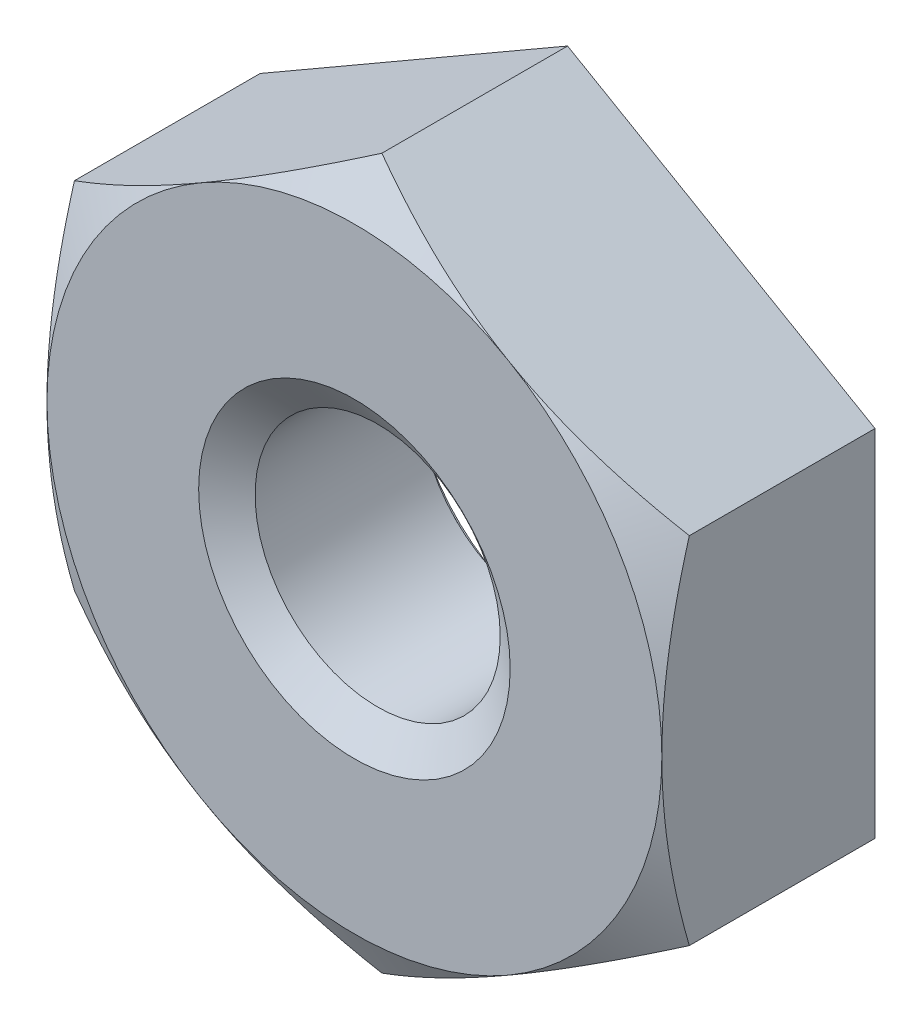
ISO-10303-21;
HEADER;
FILE_DESCRIPTION(('STEP AP214'),'2;1');
FILE_NAME('part.step','',(''),(''),'','','');
FILE_SCHEMA(('AUTOMOTIVE_DESIGN { 1 0 10303 214 1 1 1 1 }'));
ENDSEC;
DATA;
#1=APPLICATION_CONTEXT('core data for automotive mechanical design processes');
#2=APPLICATION_PROTOCOL_DEFINITION('international standard','automotive_design',2000,#1);
#3=PRODUCT_CONTEXT('',#1,'mechanical');
#4=PRODUCT('Part','Part','',(#3));
#5=PRODUCT_RELATED_PRODUCT_CATEGORY('part','',(#4));
#6=PRODUCT_DEFINITION_FORMATION('','',#4);
#7=PRODUCT_DEFINITION_CONTEXT('part definition',#1,'design');
#8=PRODUCT_DEFINITION('design','',#6,#7);
#9=PRODUCT_DEFINITION_SHAPE('','',#8);
#10=(LENGTH_UNIT() NAMED_UNIT(*) SI_UNIT(.MILLI.,.METRE.));
#11=(NAMED_UNIT(*) PLANE_ANGLE_UNIT() SI_UNIT($,.RADIAN.));
#12=(NAMED_UNIT(*) SI_UNIT($,.STERADIAN.) SOLID_ANGLE_UNIT());
#13=UNCERTAINTY_MEASURE_WITH_UNIT(LENGTH_MEASURE(1.E-05),#10,'distance_accuracy_value','');
#14=(GEOMETRIC_REPRESENTATION_CONTEXT(3) GLOBAL_UNCERTAINTY_ASSIGNED_CONTEXT((#13)) GLOBAL_UNIT_ASSIGNED_CONTEXT((#10,
#11,#12)) REPRESENTATION_CONTEXT('',''));
#15=CARTESIAN_POINT('',(0.,0.,0.));
#16=DIRECTION('',(0.,0.,1.));
#17=DIRECTION('',(1.,0.,0.));
#18=AXIS2_PLACEMENT_3D('',#15,#16,#17);
#19=CARTESIAN_POINT('',(0.,0.,-3.302));
#20=DIRECTION('',(0.,0.,1.));
#21=DIRECTION('',(1.,0.,0.));
#22=AXIS2_PLACEMENT_3D('',#19,#20,#21);
#23=CYLINDRICAL_SURFACE('',#22,1.89865);
#24=CARTESIAN_POINT('',(0.,0.,-0.360151747278165));
#25=DIRECTION('',(0.,0.,1.));
#26=DIRECTION('',(1.,0.,0.));
#27=AXIS2_PLACEMENT_3D('',#24,#25,#26);
#28=CIRCLE('',#27,1.89865);
#29=CARTESIAN_POINT('',(1.89865,0.,-0.360151747278165));
#30=VERTEX_POINT('',#29);
#31=EDGE_CURVE('E132',#30,#30,#28,.F.);
#32=ORIENTED_EDGE('',*,*,#31,.F.);
#33=EDGE_LOOP('',(#32));
#34=FACE_BOUND('',#33,.T.);
#35=CARTESIAN_POINT('',(0.,0.,-2.91644825272183));
#36=DIRECTION('',(0.,0.,-1.));
#37=DIRECTION('',(-1.,0.,0.));
#38=AXIS2_PLACEMENT_3D('',#35,#36,#37);
#39=CIRCLE('',#38,1.89865);
#40=CARTESIAN_POINT('',(-1.89865,0.,-2.91644825272183));
#41=VERTEX_POINT('',#40);
#42=EDGE_CURVE('E38',#41,#41,#39,.F.);
#43=ORIENTED_EDGE('',*,*,#42,.F.);
#44=EDGE_LOOP('',(#43));
#45=FACE_BOUND('',#44,.T.);
#46=ADVANCED_FACE('F33',(#34,#45),#23,.F.);
#47=CARTESIAN_POINT('',(0.,5.49926131403119,-3.302));
#48=DIRECTION('',(-0.5,0.866025403784438,0.));
#49=DIRECTION('',(-0.866025403784438,-0.5,0.));
#50=AXIS2_PLACEMENT_3D('',#47,#48,#49);
#51=PLANE('',#50);
#52=DIRECTION('',(0.,0.,1.));
#53=VECTOR('',#52,1.);
#54=CARTESIAN_POINT('',(-4.7625,2.74963065701559,-3.302));
#55=LINE('',#54,#53);
#56=CARTESIAN_POINT('',(-4.7625,2.74963065701559,-3.302));
#57=VERTEX_POINT('',#56);
#58=CARTESIAN_POINT('',(-4.7625,2.74963065701559,-0.42536934298441));
#59=VERTEX_POINT('',#58);
#60=EDGE_CURVE('E229',#57,#59,#55,.T.);
#61=ORIENTED_EDGE('',*,*,#60,.T.);
#62=CARTESIAN_POINT('',(-4.7627,2.74951518696175,-0.425436011750768));
#63=CARTESIAN_POINT('',(-4.55340263838612,2.8703530750302,-0.355653612413946));
#64=CARTESIAN_POINT('',(-4.34231515161877,2.9922244923379,-0.292183264615225));
#65=CARTESIAN_POINT('',(-3.91648500907588,3.23807763976409,-0.181395196068724));
#66=CARTESIAN_POINT('',(-3.701734787416,3.36206373804796,-0.134116665429797));
#67=CARTESIAN_POINT('',(-3.27486304406647,3.60851825398025,-0.0605335253687856));
#68=CARTESIAN_POINT('',(-3.06280800150458,3.73094828988637,-0.0337387922017277));
#69=CARTESIAN_POINT('',(-2.7439794939507,3.91502401454793,-0.0097111221808775));
#70=CARTESIAN_POINT('',(-2.63763059112772,3.97642458222081,-0.00439464100931432));
#71=CARTESIAN_POINT('',(-2.42483449751002,4.09928246415348,0.000759836568293832));
#72=CARTESIAN_POINT('',(-2.31838730985274,4.1607397766019,0.000598002190792683));
#73=CARTESIAN_POINT('',(-2.02675051194544,4.32911636037927,-0.00738494982191049));
#74=CARTESIAN_POINT('',(-1.84165753319303,4.43597984148709,-0.0207924204878942));
#75=CARTESIAN_POINT('',(-1.47270002105863,4.64899756043742,-0.0633078628436923));
#76=CARTESIAN_POINT('',(-1.28883678458933,4.75515104950704,-0.0924303682801016));
#77=CARTESIAN_POINT('',(-0.919135889202233,4.96859796097843,-0.165229253586901));
#78=CARTESIAN_POINT('',(-0.733344890273213,5.07586444422311,-0.209214113046655));
#79=CARTESIAN_POINT('',(-0.364533730991679,5.28879766631444,-0.309042279938828));
#80=CARTESIAN_POINT('',(-0.181508846544092,5.39446713261866,-0.364862134678058));
#81=CARTESIAN_POINT('',(0.000199999999998903,5.49937678408502,-0.425436011750769));
#82=B_SPLINE_CURVE_WITH_KNOTS('',3,(#62,#63,#64,#65,#66,#67,#68,#69,#70,#71,#72,#73,#74,#75,#76,
#77,#78,#79,#80,#81),.UNSPECIFIED.,.F.,.F.,(4,2,2,2,2,2,2,2,2,4),(0.,0.754910190012919,
1.51163483480638,2.24963134670895,2.61827336240839,2.9869039913527,3.6286742319225,
4.27103902109237,4.92765153591996,5.58297484368455),.UNSPECIFIED.);
#83=CARTESIAN_POINT('',(-2.38125,4.12444598552339,0.));
#84=VERTEX_POINT('',#83);
#85=EDGE_CURVE('E118',#59,#84,#82,.T.);
#86=ORIENTED_EDGE('',*,*,#85,.T.);
#87=CARTESIAN_POINT('',(0.,5.49926131403119,-0.425369342984409));
#88=VERTEX_POINT('',#87);
#89=EDGE_CURVE('E144',#84,#88,#82,.T.);
#90=ORIENTED_EDGE('',*,*,#89,.T.);
#91=DIRECTION('',(0.,0.,1.));
#92=VECTOR('',#91,1.);
#93=CARTESIAN_POINT('',(0.,5.49926131403119,-3.302));
#94=LINE('',#93,#92);
#95=CARTESIAN_POINT('',(0.,5.49926131403119,-3.302));
#96=VERTEX_POINT('',#95);
#97=EDGE_CURVE('E241',#96,#88,#94,.T.);
#98=ORIENTED_EDGE('',*,*,#97,.F.);
#99=DIRECTION('',(-0.866025403784438,-0.5,0.));
#100=VECTOR('',#99,1.);
#101=CARTESIAN_POINT('',(0.,5.49926131403119,-3.302));
#102=LINE('',#101,#100);
#103=EDGE_CURVE('E257',#96,#57,#102,.T.);
#104=ORIENTED_EDGE('',*,*,#103,.T.);
#105=EDGE_LOOP('',(#61,#86,#90,#98,#104));
#106=FACE_BOUND('',#105,.T.);
#107=ADVANCED_FACE('F35',(#106),#51,.T.);
#108=CARTESIAN_POINT('',(4.7625,2.74963065701559,-3.302));
#109=DIRECTION('',(0.5,0.866025403784438,0.));
#110=DIRECTION('',(-0.866025403784439,0.5,0.));
#111=AXIS2_PLACEMENT_3D('',#108,#109,#110);
#112=PLANE('',#111);
#113=ORIENTED_EDGE('',*,*,#97,.T.);
#114=CARTESIAN_POINT('',(-0.00020000000000067,5.49937678408502,-0.425436011750769));
#115=CARTESIAN_POINT('',(0.209097361613878,5.37853889601657,-0.355653612413947));
#116=CARTESIAN_POINT('',(0.420184848381228,5.25666747870888,-0.292183264615226));
#117=CARTESIAN_POINT('',(0.846014990924115,5.01081433128269,-0.181395196068725));
#118=CARTESIAN_POINT('',(1.060765212584,4.88682823299882,-0.134116665429797));
#119=CARTESIAN_POINT('',(1.48763695593353,4.64037371706653,-0.0605335253687858));
#120=CARTESIAN_POINT('',(1.69969199849542,4.51794368116041,-0.0337387922017279));
#121=CARTESIAN_POINT('',(2.0185205060493,4.33386795649884,-0.0097111221808778));
#122=CARTESIAN_POINT('',(2.12486940887228,4.27246738882597,-0.00439464100931466));
#123=CARTESIAN_POINT('',(2.33766550248998,4.14960950689329,0.000759836568293665));
#124=CARTESIAN_POINT('',(2.44411269014726,4.08815219444488,0.000598002190792721));
#125=CARTESIAN_POINT('',(2.73574948805456,3.9197756106675,-0.00738494982191021));
#126=CARTESIAN_POINT('',(2.92084246680697,3.81291212955969,-0.0207924204878941));
#127=CARTESIAN_POINT('',(3.28979997894137,3.59989441060936,-0.063307862843692));
#128=CARTESIAN_POINT('',(3.47366321541067,3.49374092153974,-0.0924303682801009));
#129=CARTESIAN_POINT('',(3.84336411079777,3.28029401006835,-0.1652292535869));
#130=CARTESIAN_POINT('',(4.02915510972679,3.17302752682367,-0.209214113046654));
#131=CARTESIAN_POINT('',(4.39796626900832,2.96009430473234,-0.309042279938827));
#132=CARTESIAN_POINT('',(4.58099115345591,2.85442483842812,-0.364862134678057));
#133=CARTESIAN_POINT('',(4.7627,2.74951518696176,-0.425436011750768));
#134=B_SPLINE_CURVE_WITH_KNOTS('',3,(#114,#115,#116,#117,#118,#119,#120,#121,#122,#123,#124,
#125,#126,#127,#128,#129,#130,#131,#132,#133),.UNSPECIFIED.,.F.,.F.,(4,2,2,2,2,2,2,2,2,4),(0.,
0.754910190012918,1.51163483480638,2.24963134670895,2.61827336240839,2.9869039913527,
3.6286742319225,4.27103902109236,4.92765153591996,5.58297484368455),.UNSPECIFIED.);
#135=CARTESIAN_POINT('',(2.38125,4.12444598552339,0.));
#136=VERTEX_POINT('',#135);
#137=EDGE_CURVE('E140',#88,#136,#134,.T.);
#138=ORIENTED_EDGE('',*,*,#137,.T.);
#139=CARTESIAN_POINT('',(4.7625,2.74963065701559,-0.425369342984409));
#140=VERTEX_POINT('',#139);
#141=EDGE_CURVE('E127',#136,#140,#134,.T.);
#142=ORIENTED_EDGE('',*,*,#141,.T.);
#143=DIRECTION('',(0.,0.,1.));
#144=VECTOR('',#143,1.);
#145=CARTESIAN_POINT('',(4.7625,2.74963065701559,-3.302));
#146=LINE('',#145,#144);
#147=CARTESIAN_POINT('',(4.7625,2.74963065701559,-3.302));
#148=VERTEX_POINT('',#147);
#149=EDGE_CURVE('E139',#148,#140,#146,.T.);
#150=ORIENTED_EDGE('',*,*,#149,.F.);
#151=DIRECTION('',(-0.866025403784439,0.5,0.));
#152=VECTOR('',#151,1.);
#153=CARTESIAN_POINT('',(4.7625,2.74963065701559,-3.302));
#154=LINE('',#153,#152);
#155=EDGE_CURVE('E233',#148,#96,#154,.T.);
#156=ORIENTED_EDGE('',*,*,#155,.T.);
#157=EDGE_LOOP('',(#113,#138,#142,#150,#156));
#158=FACE_BOUND('',#157,.T.);
#159=ADVANCED_FACE('F209',(#158),#112,.T.);
#160=CARTESIAN_POINT('',(4.7625,2.74963065701559,-3.302));
#161=DIRECTION('',(-1.,0.,0.));
#162=DIRECTION('',(0.,0.,1.));
#163=AXIS2_PLACEMENT_3D('',#160,#161,#162);
#164=PLANE('',#163);
#165=CARTESIAN_POINT('',(4.7625,-7.29242571304484,-2.27898343403964));
#166=CARTESIAN_POINT('',(4.7625,-7.08332503258644,-2.17793443460892));
#167=CARTESIAN_POINT('',(4.7625,-6.87372996761939,-2.07788994627171));
#168=CARTESIAN_POINT('',(4.7625,-6.45328375890254,-1.88038400304187));
#169=CARTESIAN_POINT('',(4.7625,-6.24243240531597,-1.78292299537275));
#170=CARTESIAN_POINT('',(4.7625,-5.81806730761599,-1.59064459480452));
#171=CARTESIAN_POINT('',(4.7625,-5.60454523269943,-1.49584552190854));
#172=CARTESIAN_POINT('',(4.7625,-5.17574610716181,-1.31031922922938));
#173=CARTESIAN_POINT('',(4.7625,-4.96046914871243,-1.21959179719919));
#174=CARTESIAN_POINT('',(4.7625,-4.5251454275538,-1.04221436450315));
#175=CARTESIAN_POINT('',(4.7625,-4.30507255346546,-0.955628096677138));
#176=CARTESIAN_POINT('',(4.7625,-3.86233085885286,-0.789237026079922));
#177=CARTESIAN_POINT('',(4.7625,-3.6396617526365,-0.709432977795152));
#178=CARTESIAN_POINT('',(4.7625,-3.19183146915336,-0.558750437330524));
#179=CARTESIAN_POINT('',(4.7625,-2.96667674136296,-0.487852969464109));
#180=CARTESIAN_POINT('',(4.7625,-2.51316408606383,-0.357286935151366));
#181=CARTESIAN_POINT('',(4.7625,-2.28480719615869,-0.297614817726105));
#182=CARTESIAN_POINT('',(4.7625,-1.82474524250015,-0.192393335725107));
#183=CARTESIAN_POINT('',(4.7625,-1.59303930440612,-0.146847731515044));
#184=CARTESIAN_POINT('',(4.7625,-1.12680140245445,-0.0729572667243255));
#185=CARTESIAN_POINT('',(4.7625,-0.892269436098448,-0.044612421351302));
#186=CARTESIAN_POINT('',(4.7625,-0.54009824342306,-0.0168127698224292));
#187=CARTESIAN_POINT('',(4.7625,-0.423010288487476,-0.00999774479560567));
#188=CARTESIAN_POINT('',(4.7625,-0.188645495023605,-0.00132916739532984));
#189=CARTESIAN_POINT('',(4.7625,-0.0713686589679975,0.000524449409052411));
#190=CARTESIAN_POINT('',(4.7625,0.163123105354889,-0.000779595326750137));
#191=CARTESIAN_POINT('',(4.7625,0.280338041752277,-0.00393584200216364));
#192=CARTESIAN_POINT('',(4.7625,0.514533140154534,-0.0151795737408435));
#193=CARTESIAN_POINT('',(4.7625,0.631513289308025,-0.0232673217280265));
#194=CARTESIAN_POINT('',(4.7625,0.915050030184752,-0.0486788919016494));
#195=CARTESIAN_POINT('',(4.7625,1.08138937418057,-0.0684745311551047));
#196=CARTESIAN_POINT('',(4.7625,1.41276151801412,-0.116933997609662));
#197=CARTESIAN_POINT('',(4.7625,1.57779414061617,-0.145599007360524));
#198=CARTESIAN_POINT('',(4.7625,2.07083902042289,-0.243383100627567));
#199=CARTESIAN_POINT('',(4.7625,2.39654516294855,-0.324265654459847));
#200=CARTESIAN_POINT('',(4.7625,2.88391142522151,-0.463767781303893));
#201=CARTESIAN_POINT('',(4.7625,3.04811363656015,-0.514009375908409));
#202=CARTESIAN_POINT('',(4.7625,3.37480455011008,-0.619463864370054));
#203=CARTESIAN_POINT('',(4.7625,3.53729434901436,-0.674673329356533));
#204=CARTESIAN_POINT('',(4.7625,3.85988055284394,-0.788914900372858));
#205=CARTESIAN_POINT('',(4.7625,4.01998528140539,-0.847923740867389));
#206=CARTESIAN_POINT('',(4.7625,4.33895253974561,-0.969404920092013));
#207=CARTESIAN_POINT('',(4.7625,4.49781453744471,-1.03187865865025));
#208=CARTESIAN_POINT('',(4.7625,4.65610216606021,-1.09574291091383));
#209=B_SPLINE_CURVE_WITH_KNOTS('',3,(#165,#166,#167,#168,#169,#170,#171,#172,#173,#174,#175,
#176,#177,#178,#179,#180,#181,#182,#183,#184,#185,#186,#187,#188,#189,#190,#191,#192,#193,#194,
#195,#196,#197,#198,#199,#200,#201,#202,#203,#204,#205,#206,#207,#208),.UNSPECIFIED.,.F.,.F.,(4,
2,2,2,2,2,2,2,2,2,2,2,2,2,2,2,2,2,2,2,2,4),(0.,0.696720165483734,1.39356016205725,
2.09438789250381,2.79517904757872,3.50457374312629,4.21404725210226,4.9219826078058,
5.6296936403172,6.33759289852653,7.04549278260686,7.39726182154395,7.74902629223847,
8.10069143675107,8.45237533199633,8.95462912158064,9.45694990534677,10.4623513294482,
10.9774608355396,11.4922174961111,12.0040767603637,12.5161443452105),.UNSPECIFIED.);
#210=CARTESIAN_POINT('',(4.7625,-2.74963065701559,-0.425369342984409));
#211=VERTEX_POINT('',#210);
#212=CARTESIAN_POINT('',(4.7625,0.,0.));
#213=VERTEX_POINT('',#212);
#214=EDGE_CURVE('E107',#211,#213,#209,.T.);
#215=ORIENTED_EDGE('',*,*,#214,.F.);
#216=DIRECTION('',(0.,0.,1.));
#217=VECTOR('',#216,1.);
#218=CARTESIAN_POINT('',(4.7625,-2.74963065701559,-3.302));
#219=LINE('',#218,#217);
#220=CARTESIAN_POINT('',(4.7625,-2.74963065701559,-3.302));
#221=VERTEX_POINT('',#220);
#222=EDGE_CURVE('E238',#221,#211,#219,.T.);
#223=ORIENTED_EDGE('',*,*,#222,.F.);
#224=DIRECTION('',(0.,-1.,0.));
#225=VECTOR('',#224,1.);
#226=CARTESIAN_POINT('',(4.7625,2.74963065701559,-3.302));
#227=LINE('',#226,#225);
#228=EDGE_CURVE('E246',#148,#221,#227,.T.);
#229=ORIENTED_EDGE('',*,*,#228,.F.);
#230=ORIENTED_EDGE('',*,*,#149,.T.);
#231=EDGE_CURVE('E120',#213,#140,#209,.T.);
#232=ORIENTED_EDGE('',*,*,#231,.F.);
#233=EDGE_LOOP('',(#215,#223,#229,#230,#232));
#234=FACE_BOUND('',#233,.T.);
#235=ADVANCED_FACE('F137',(#234),#164,.F.);
#236=CARTESIAN_POINT('',(0.,-5.49926131403119,-3.302));
#237=DIRECTION('',(0.5,-0.866025403784438,0.));
#238=DIRECTION('',(0.866025403784438,0.5,0.));
#239=AXIS2_PLACEMENT_3D('',#236,#237,#238);
#240=PLANE('',#239);
#241=ORIENTED_EDGE('',*,*,#222,.T.);
#242=CARTESIAN_POINT('',(4.7627,-2.74951518696176,-0.425436011750769));
#243=CARTESIAN_POINT('',(4.55340263838612,-2.87035307503021,-0.355653612413947));
#244=CARTESIAN_POINT('',(4.34231515161877,-2.9922244923379,-0.292183264615226));
#245=CARTESIAN_POINT('',(3.91648500907589,-3.23807763976409,-0.181395196068725));
#246=CARTESIAN_POINT('',(3.701734787416,-3.36206373804796,-0.134116665429798));
#247=CARTESIAN_POINT('',(3.27486304406647,-3.60851825398025,-0.0605335253687867));
#248=CARTESIAN_POINT('',(3.06280800150458,-3.73094828988638,-0.0337387922017292));
#249=CARTESIAN_POINT('',(2.7439794939507,-3.91502401454794,-0.00971112218087938));
#250=CARTESIAN_POINT('',(2.63763059112771,-3.97642458222081,-0.00439464100931626));
#251=CARTESIAN_POINT('',(2.42483449751002,-4.09928246415349,0.000759836568292012));
#252=CARTESIAN_POINT('',(2.31838730985274,-4.1607397766019,0.000598002190791066));
#253=CARTESIAN_POINT('',(2.02675051194544,-4.32911636037928,-0.00738494982191179));
#254=CARTESIAN_POINT('',(1.84165753319303,-4.43597984148709,-0.0207924204878956));
#255=CARTESIAN_POINT('',(1.47270002105863,-4.64899756043742,-0.063307862843694));
#256=CARTESIAN_POINT('',(1.28883678458933,-4.75515104950705,-0.0924303682801035));
#257=CARTESIAN_POINT('',(0.919135889202232,-4.96859796097843,-0.165229253586903));
#258=CARTESIAN_POINT('',(0.733344890273212,-5.07586444422311,-0.209214113046657));
#259=CARTESIAN_POINT('',(0.364533730991679,-5.28879766631445,-0.30904227993883));
#260=CARTESIAN_POINT('',(0.181508846544092,-5.39446713261866,-0.36486213467806));
#261=CARTESIAN_POINT('',(-0.00019999999999926,-5.49937678408503,-0.425436011750771));
#262=B_SPLINE_CURVE_WITH_KNOTS('',3,(#242,#243,#244,#245,#246,#247,#248,#249,#250,#251,#252,
#253,#254,#255,#256,#257,#258,#259,#260,#261),.UNSPECIFIED.,.F.,.F.,(4,2,2,2,2,2,2,2,2,4),(0.,
0.754910190012918,1.51163483480638,2.24963134670895,2.61827336240839,2.9869039913527,
3.6286742319225,4.27103902109237,4.92765153591996,5.58297484368455),.UNSPECIFIED.);
#263=CARTESIAN_POINT('',(2.38125,-4.12444598552339,0.));
#264=VERTEX_POINT('',#263);
#265=EDGE_CURVE('E113',#211,#264,#262,.T.);
#266=ORIENTED_EDGE('',*,*,#265,.T.);
#267=CARTESIAN_POINT('',(0.,-5.49926131403119,-0.425369342984409));
#268=VERTEX_POINT('',#267);
#269=EDGE_CURVE('E52',#264,#268,#262,.T.);
#270=ORIENTED_EDGE('',*,*,#269,.T.);
#271=DIRECTION('',(0.,0.,1.));
#272=VECTOR('',#271,1.);
#273=CARTESIAN_POINT('',(0.,-5.49926131403119,-3.302));
#274=LINE('',#273,#272);
#275=CARTESIAN_POINT('',(0.,-5.49926131403119,-3.302));
#276=VERTEX_POINT('',#275);
#277=EDGE_CURVE('E235',#276,#268,#274,.T.);
#278=ORIENTED_EDGE('',*,*,#277,.F.);
#279=DIRECTION('',(0.866025403784438,0.5,0.));
#280=VECTOR('',#279,1.);
#281=CARTESIAN_POINT('',(0.,-5.49926131403119,-3.302));
#282=LINE('',#281,#280);
#283=EDGE_CURVE('E248',#276,#221,#282,.T.);
#284=ORIENTED_EDGE('',*,*,#283,.T.);
#285=EDGE_LOOP('',(#241,#266,#270,#278,#284));
#286=FACE_BOUND('',#285,.T.);
#287=ADVANCED_FACE('F191',(#286),#240,.T.);
#288=CARTESIAN_POINT('',(-4.7625,-2.7496306570156,-3.302));
#289=DIRECTION('',(-0.5,-0.866025403784438,0.));
#290=DIRECTION('',(0.866025403784438,-0.5,0.));
#291=AXIS2_PLACEMENT_3D('',#288,#289,#290);
#292=PLANE('',#291);
#293=ORIENTED_EDGE('',*,*,#277,.T.);
#294=CARTESIAN_POINT('',(0.000200000000000027,-5.49937678408503,-0.425436011750772));
#295=CARTESIAN_POINT('',(-0.209097361613879,-5.37853889601658,-0.355653612413949));
#296=CARTESIAN_POINT('',(-0.420184848381229,-5.25666747870889,-0.292183264615228));
#297=CARTESIAN_POINT('',(-0.846014990924115,-5.01081433128269,-0.181395196068727));
#298=CARTESIAN_POINT('',(-1.060765212584,-4.88682823299882,-0.134116665429799));
#299=CARTESIAN_POINT('',(-1.48763695593353,-4.64037371706653,-0.0605335253687883));
#300=CARTESIAN_POINT('',(-1.69969199849542,-4.51794368116041,-0.0337387922017306));
#301=CARTESIAN_POINT('',(-2.0185205060493,-4.33386795649885,-0.0097111221808798));
#302=CARTESIAN_POINT('',(-2.12486940887229,-4.27246738882597,-0.00439464100931622));
#303=CARTESIAN_POINT('',(-2.33766550248998,-4.1496095068933,0.000759836568292223));
#304=CARTESIAN_POINT('',(-2.44411269014726,-4.08815219444489,0.000598002190790979));
#305=CARTESIAN_POINT('',(-2.73574948805456,-3.91977561066751,-0.00738494982191232));
#306=CARTESIAN_POINT('',(-2.92084246680697,-3.81291212955969,-0.020792420487896));
#307=CARTESIAN_POINT('',(-3.28979997894137,-3.59989441060936,-0.0633078628436935));
#308=CARTESIAN_POINT('',(-3.47366321541067,-3.49374092153974,-0.0924303682801024));
#309=CARTESIAN_POINT('',(-3.84336411079777,-3.28029401006835,-0.165229253586902));
#310=CARTESIAN_POINT('',(-4.02915510972679,-3.17302752682367,-0.209214113046655));
#311=CARTESIAN_POINT('',(-4.39796626900832,-2.96009430473234,-0.309042279938828));
#312=CARTESIAN_POINT('',(-4.58099115345591,-2.85442483842812,-0.364862134678059));
#313=CARTESIAN_POINT('',(-4.7627,-2.74951518696176,-0.425436011750769));
#314=B_SPLINE_CURVE_WITH_KNOTS('',3,(#294,#295,#296,#297,#298,#299,#300,#301,#302,#303,#304,
#305,#306,#307,#308,#309,#310,#311,#312,#313),.UNSPECIFIED.,.F.,.F.,(4,2,2,2,2,2,2,2,2,4),(0.,
0.754910190012918,1.51163483480638,2.24963134670895,2.6182733624084,2.9869039913527,
3.6286742319225,4.27103902109237,4.92765153591996,5.58297484368455),.UNSPECIFIED.);
#315=CARTESIAN_POINT('',(-2.38125,-4.12444598552339,0.));
#316=VERTEX_POINT('',#315);
#317=EDGE_CURVE('E185',#268,#316,#314,.T.);
#318=ORIENTED_EDGE('',*,*,#317,.T.);
#319=CARTESIAN_POINT('',(-4.7625,-2.74963065701559,-0.425369342984409));
#320=VERTEX_POINT('',#319);
#321=EDGE_CURVE('E59',#316,#320,#314,.T.);
#322=ORIENTED_EDGE('',*,*,#321,.T.);
#323=DIRECTION('',(0.,0.,1.));
#324=VECTOR('',#323,1.);
#325=CARTESIAN_POINT('',(-4.7625,-2.7496306570156,-3.302));
#326=LINE('',#325,#324);
#327=CARTESIAN_POINT('',(-4.7625,-2.7496306570156,-3.302));
#328=VERTEX_POINT('',#327);
#329=EDGE_CURVE('E232',#328,#320,#326,.T.);
#330=ORIENTED_EDGE('',*,*,#329,.F.);
#331=DIRECTION('',(0.866025403784438,-0.5,0.));
#332=VECTOR('',#331,1.);
#333=CARTESIAN_POINT('',(-4.7625,-2.7496306570156,-3.302));
#334=LINE('',#333,#332);
#335=EDGE_CURVE('E251',#328,#276,#334,.T.);
#336=ORIENTED_EDGE('',*,*,#335,.T.);
#337=EDGE_LOOP('',(#293,#318,#322,#330,#336));
#338=FACE_BOUND('',#337,.T.);
#339=ADVANCED_FACE('F187',(#338),#292,.T.);
#340=CARTESIAN_POINT('',(-4.7625,2.74963065701559,-3.302));
#341=DIRECTION('',(-1.,0.,0.));
#342=DIRECTION('',(0.,0.,1.));
#343=AXIS2_PLACEMENT_3D('',#340,#341,#342);
#344=PLANE('',#343);
#345=ORIENTED_EDGE('',*,*,#329,.T.);
#346=CARTESIAN_POINT('',(-4.7625,-7.29242571304484,-2.27898343403964));
#347=CARTESIAN_POINT('',(-4.7625,-7.08332503258644,-2.17793443460892));
#348=CARTESIAN_POINT('',(-4.7625,-6.87372996761939,-2.07788994627171));
#349=CARTESIAN_POINT('',(-4.7625,-6.45328375890254,-1.88038400304187));
#350=CARTESIAN_POINT('',(-4.7625,-6.24243240531597,-1.78292299537275));
#351=CARTESIAN_POINT('',(-4.7625,-5.81806730761599,-1.59064459480452));
#352=CARTESIAN_POINT('',(-4.7625,-5.60454523269943,-1.49584552190854));
#353=CARTESIAN_POINT('',(-4.7625,-5.17574610716181,-1.31031922922938));
#354=CARTESIAN_POINT('',(-4.7625,-4.96046914871242,-1.21959179719919));
#355=CARTESIAN_POINT('',(-4.7625,-4.5251454275538,-1.04221436450315));
#356=CARTESIAN_POINT('',(-4.7625,-4.30507255346546,-0.955628096677138));
#357=CARTESIAN_POINT('',(-4.7625,-3.86233085885286,-0.789237026079922));
#358=CARTESIAN_POINT('',(-4.7625,-3.6396617526365,-0.709432977795151));
#359=CARTESIAN_POINT('',(-4.7625,-3.19183146915336,-0.558750437330523));
#360=CARTESIAN_POINT('',(-4.7625,-2.96667674136296,-0.487852969464109));
#361=CARTESIAN_POINT('',(-4.7625,-2.51316408606383,-0.357286935151366));
#362=CARTESIAN_POINT('',(-4.7625,-2.28480719615869,-0.297614817726105));
#363=CARTESIAN_POINT('',(-4.7625,-1.82474524250015,-0.192393335725107));
#364=CARTESIAN_POINT('',(-4.7625,-1.59303930440612,-0.146847731515045));
#365=CARTESIAN_POINT('',(-4.7625,-1.12680140245445,-0.0729572667243259));
#366=CARTESIAN_POINT('',(-4.7625,-0.892269436098449,-0.0446124213513021));
#367=CARTESIAN_POINT('',(-4.7625,-0.540098243423061,-0.0168127698224291));
#368=CARTESIAN_POINT('',(-4.7625,-0.423010288487477,-0.00999774479560566));
#369=CARTESIAN_POINT('',(-4.7625,-0.188645495023606,-0.00132916739532985));
#370=CARTESIAN_POINT('',(-4.7625,-0.0713686589679985,0.000524449409052393));
#371=CARTESIAN_POINT('',(-4.7625,0.163123105354888,-0.000779595326750121));
#372=CARTESIAN_POINT('',(-4.7625,0.280338041752277,-0.0039358420021636));
#373=CARTESIAN_POINT('',(-4.7625,0.514533140154534,-0.0151795737408435));
#374=CARTESIAN_POINT('',(-4.7625,0.631513289308025,-0.0232673217280265));
#375=CARTESIAN_POINT('',(-4.7625,0.915050030184751,-0.0486788919016494));
#376=CARTESIAN_POINT('',(-4.7625,1.08138937418057,-0.0684745311551047));
#377=CARTESIAN_POINT('',(-4.7625,1.41276151801412,-0.116933997609662));
#378=CARTESIAN_POINT('',(-4.7625,1.57779414061616,-0.145599007360524));
#379=CARTESIAN_POINT('',(-4.7625,2.07083902042289,-0.243383100627567));
#380=CARTESIAN_POINT('',(-4.7625,2.39654516294854,-0.324265654459846));
#381=CARTESIAN_POINT('',(-4.7625,2.88391142522151,-0.463767781303893));
#382=CARTESIAN_POINT('',(-4.7625,3.04811363656015,-0.514009375908409));
#383=CARTESIAN_POINT('',(-4.7625,3.37480455011008,-0.619463864370054));
#384=CARTESIAN_POINT('',(-4.7625,3.53729434901436,-0.674673329356533));
#385=CARTESIAN_POINT('',(-4.7625,3.85988055284394,-0.788914900372858));
#386=CARTESIAN_POINT('',(-4.7625,4.01998528140539,-0.847923740867388));
#387=CARTESIAN_POINT('',(-4.7625,4.33895253974561,-0.969404920092013));
#388=CARTESIAN_POINT('',(-4.7625,4.49781453744471,-1.03187865865025));
#389=CARTESIAN_POINT('',(-4.7625,4.65610216606021,-1.09574291091383));
#390=B_SPLINE_CURVE_WITH_KNOTS('',3,(#346,#347,#348,#349,#350,#351,#352,#353,#354,#355,#356,
#357,#358,#359,#360,#361,#362,#363,#364,#365,#366,#367,#368,#369,#370,#371,#372,#373,#374,#375,
#376,#377,#378,#379,#380,#381,#382,#383,#384,#385,#386,#387,#388,#389),.UNSPECIFIED.,.F.,.F.,(4,
2,2,2,2,2,2,2,2,2,2,2,2,2,2,2,2,2,2,2,2,4),(0.,0.696720165483736,1.39356016205726,
2.09438789250382,2.79517904757872,3.50457374312629,4.21404725210227,4.92198260780581,
5.6296936403172,6.33759289852653,7.04549278260686,7.39726182154395,7.74902629223847,
8.10069143675107,8.45237533199633,8.95462912158064,9.45694990534677,10.4623513294482,
10.9774608355396,11.4922174961111,12.0040767603637,12.5161443452105),.UNSPECIFIED.);
#391=CARTESIAN_POINT('',(-4.7625,0.,0.));
#392=VERTEX_POINT('',#391);
#393=EDGE_CURVE('E186',#320,#392,#390,.T.);
#394=ORIENTED_EDGE('',*,*,#393,.T.);
#395=EDGE_CURVE('E131',#392,#59,#390,.T.);
#396=ORIENTED_EDGE('',*,*,#395,.T.);
#397=ORIENTED_EDGE('',*,*,#60,.F.);
#398=DIRECTION('',(0.,-1.,0.));
#399=VECTOR('',#398,1.);
#400=CARTESIAN_POINT('',(-4.7625,2.74963065701559,-3.302));
#401=LINE('',#400,#399);
#402=EDGE_CURVE('E254',#57,#328,#401,.T.);
#403=ORIENTED_EDGE('',*,*,#402,.T.);
#404=EDGE_LOOP('',(#345,#394,#396,#397,#403));
#405=FACE_BOUND('',#404,.T.);
#406=ADVANCED_FACE('F190',(#405),#344,.T.);
#407=CARTESIAN_POINT('',(-9.525,0.,0.));
#408=DIRECTION('',(0.,0.,1.));
#409=DIRECTION('',(1.,0.,0.));
#410=AXIS2_PLACEMENT_3D('',#407,#408,#409);
#411=PLANE('',#410);
#412=CARTESIAN_POINT('',(0.,0.,0.));
#413=DIRECTION('',(0.,0.,1.));
#414=DIRECTION('',(1.,0.,0.));
#415=AXIS2_PLACEMENT_3D('',#412,#413,#414);
#416=CIRCLE('',#415,2.413);
#417=CARTESIAN_POINT('',(2.413,0.,0.));
#418=VERTEX_POINT('',#417);
#419=EDGE_CURVE('E217',#418,#418,#416,.T.);
#420=ORIENTED_EDGE('',*,*,#419,.F.);
#421=EDGE_LOOP('',(#420));
#422=FACE_BOUND('',#421,.T.);
#423=CARTESIAN_POINT('',(0.,0.,0.));
#424=DIRECTION('',(0.,0.,1.));
#425=DIRECTION('',(1.,0.,0.));
#426=AXIS2_PLACEMENT_3D('',#423,#424,#425);
#427=CIRCLE('',#426,4.7625);
#428=EDGE_CURVE('E11',#213,#264,#427,.F.);
#429=ORIENTED_EDGE('',*,*,#428,.F.);
#430=CARTESIAN_POINT('',(0.,0.,0.));
#431=DIRECTION('',(0.,0.,1.));
#432=DIRECTION('',(1.,0.,0.));
#433=AXIS2_PLACEMENT_3D('',#430,#431,#432);
#434=CIRCLE('',#433,4.7625);
#435=EDGE_CURVE('E124',#213,#136,#434,.T.);
#436=ORIENTED_EDGE('',*,*,#435,.T.);
#437=EDGE_CURVE('E45',#84,#136,#427,.F.);
#438=ORIENTED_EDGE('',*,*,#437,.F.);
#439=EDGE_CURVE('E284',#392,#84,#427,.F.);
#440=ORIENTED_EDGE('',*,*,#439,.F.);
#441=EDGE_CURVE('E285',#316,#392,#427,.F.);
#442=ORIENTED_EDGE('',*,*,#441,.F.);
#443=EDGE_CURVE('E43',#264,#316,#427,.F.);
#444=ORIENTED_EDGE('',*,*,#443,.F.);
#445=EDGE_LOOP('',(#429,#436,#438,#440,#442,#444));
#446=FACE_BOUND('',#445,.T.);
#447=ADVANCED_FACE('F134',(#422,#446),#411,.T.);
#448=CARTESIAN_POINT('',(-9.525,0.,-3.302));
#449=DIRECTION('',(0.,0.,1.));
#450=DIRECTION('',(1.,0.,0.));
#451=AXIS2_PLACEMENT_3D('',#448,#449,#450);
#452=PLANE('',#451);
#453=CARTESIAN_POINT('',(0.,0.,-3.302));
#454=DIRECTION('',(0.,0.,1.));
#455=DIRECTION('',(1.,0.,0.));
#456=AXIS2_PLACEMENT_3D('',#453,#454,#455);
#457=CIRCLE('',#456,2.413);
#458=CARTESIAN_POINT('',(2.413,0.,-3.302));
#459=VERTEX_POINT('',#458);
#460=EDGE_CURVE('E218',#459,#459,#457,.F.);
#461=ORIENTED_EDGE('',*,*,#460,.F.);
#462=EDGE_LOOP('',(#461));
#463=FACE_BOUND('',#462,.T.);
#464=ORIENTED_EDGE('',*,*,#103,.F.);
#465=ORIENTED_EDGE('',*,*,#155,.F.);
#466=ORIENTED_EDGE('',*,*,#228,.T.);
#467=ORIENTED_EDGE('',*,*,#283,.F.);
#468=ORIENTED_EDGE('',*,*,#335,.F.);
#469=ORIENTED_EDGE('',*,*,#402,.F.);
#470=EDGE_LOOP('',(#464,#465,#466,#467,#468,#469));
#471=FACE_BOUND('',#470,.T.);
#472=ADVANCED_FACE('F200',(#463,#471),#452,.F.);
#473=CARTESIAN_POINT('',(0.,0.,0.));
#474=DIRECTION('',(0.,0.,-1.));
#475=DIRECTION('',(-1.,0.,0.));
#476=AXIS2_PLACEMENT_3D('',#473,#474,#475);
#477=CONICAL_SURFACE('',#476,4.7625,1.0471975511966);
#478=ORIENTED_EDGE('',*,*,#435,.F.);
#479=ORIENTED_EDGE('',*,*,#231,.T.);
#480=ORIENTED_EDGE('',*,*,#141,.F.);
#481=EDGE_LOOP('',(#478,#479,#480));
#482=FACE_BOUND('',#481,.T.);
#483=ADVANCED_FACE('F125',(#482),#477,.T.);
#484=ORIENTED_EDGE('',*,*,#437,.T.);
#485=ORIENTED_EDGE('',*,*,#137,.F.);
#486=ORIENTED_EDGE('',*,*,#89,.F.);
#487=EDGE_LOOP('',(#484,#485,#486));
#488=FACE_BOUND('',#487,.T.);
#489=ADVANCED_FACE('F168',(#488),#477,.T.);
#490=ORIENTED_EDGE('',*,*,#395,.F.);
#491=ORIENTED_EDGE('',*,*,#439,.T.);
#492=ORIENTED_EDGE('',*,*,#85,.F.);
#493=EDGE_LOOP('',(#490,#491,#492));
#494=FACE_BOUND('',#493,.T.);
#495=ADVANCED_FACE('F167',(#494),#477,.T.);
#496=ORIENTED_EDGE('',*,*,#441,.T.);
#497=ORIENTED_EDGE('',*,*,#393,.F.);
#498=ORIENTED_EDGE('',*,*,#321,.F.);
#499=EDGE_LOOP('',(#496,#497,#498));
#500=FACE_BOUND('',#499,.T.);
#501=ADVANCED_FACE('F161',(#500),#477,.T.);
#502=ORIENTED_EDGE('',*,*,#443,.T.);
#503=ORIENTED_EDGE('',*,*,#317,.F.);
#504=ORIENTED_EDGE('',*,*,#269,.F.);
#505=EDGE_LOOP('',(#502,#503,#504));
#506=FACE_BOUND('',#505,.T.);
#507=ADVANCED_FACE('F166',(#506),#477,.T.);
#508=ORIENTED_EDGE('',*,*,#214,.T.);
#509=ORIENTED_EDGE('',*,*,#428,.T.);
#510=ORIENTED_EDGE('',*,*,#265,.F.);
#511=EDGE_LOOP('',(#508,#509,#510));
#512=FACE_BOUND('',#511,.T.);
#513=ADVANCED_FACE('F109',(#512),#477,.T.);
#514=CARTESIAN_POINT('',(0.,0.,-0.396166922005982));
#515=DIRECTION('',(0.,0.,1.));
#516=DIRECTION('',(1.,0.,0.));
#517=AXIS2_PLACEMENT_3D('',#514,#515,#516);
#518=CONICAL_SURFACE('',#517,1.847215,0.959931088596879);
#519=ORIENTED_EDGE('',*,*,#419,.T.);
#520=EDGE_LOOP('',(#519));
#521=FACE_BOUND('',#520,.T.);
#522=ORIENTED_EDGE('',*,*,#31,.T.);
#523=EDGE_LOOP('',(#522));
#524=FACE_BOUND('',#523,.T.);
#525=ADVANCED_FACE('F169',(#521,#524),#518,.F.);
#526=CARTESIAN_POINT('',(0.,0.,-3.2766));
#527=DIRECTION('',(0.,0.,-1.));
#528=DIRECTION('',(-1.,0.,0.));
#529=AXIS2_PLACEMENT_3D('',#526,#527,#528);
#530=CONICAL_SURFACE('',#529,2.413,0.95993108859688);
#531=CARTESIAN_POINT('',(0.,0.,-3.2766));
#532=DIRECTION('',(0.,0.,1.));
#533=DIRECTION('',(1.,0.,0.));
#534=AXIS2_PLACEMENT_3D('',#531,#532,#533);
#535=CIRCLE('',#534,2.413);
#536=CARTESIAN_POINT('',(2.413,0.,-3.2766));
#537=VERTEX_POINT('',#536);
#538=EDGE_CURVE('E222',#537,#537,#535,.T.);
#539=ORIENTED_EDGE('',*,*,#538,.F.);
#540=EDGE_LOOP('',(#539));
#541=FACE_BOUND('',#540,.T.);
#542=ORIENTED_EDGE('',*,*,#42,.T.);
#543=EDGE_LOOP('',(#542));
#544=FACE_BOUND('',#543,.T.);
#545=ADVANCED_FACE('F298',(#541,#544),#530,.F.);
#546=CARTESIAN_POINT('',(0.,0.,-25.0375057290932));
#547=DIRECTION('',(0.,0.,1.));
#548=DIRECTION('',(1.,0.,0.));
#549=AXIS2_PLACEMENT_3D('',#546,#547,#548);
#550=CYLINDRICAL_SURFACE('',#549,2.413);
#551=ORIENTED_EDGE('',*,*,#538,.T.);
#552=EDGE_LOOP('',(#551));
#553=FACE_BOUND('',#552,.T.);
#554=ORIENTED_EDGE('',*,*,#460,.T.);
#555=EDGE_LOOP('',(#554));
#556=FACE_BOUND('',#555,.T.);
#557=ADVANCED_FACE('F303',(#553,#556),#550,.F.);
#558=CLOSED_SHELL('',(#46,#107,#159,#235,#287,#339,#406,#447,#472,#483,#489,#495,#501,#507,#513,
#525,#545,#557));
#559=MANIFOLD_SOLID_BREP('B2',#558);
#560=ADVANCED_BREP_SHAPE_REPRESENTATION('',(#18,#559),#14);
#561=SHAPE_DEFINITION_REPRESENTATION(#9,#560);
ENDSEC;
END-ISO-10303-21;
